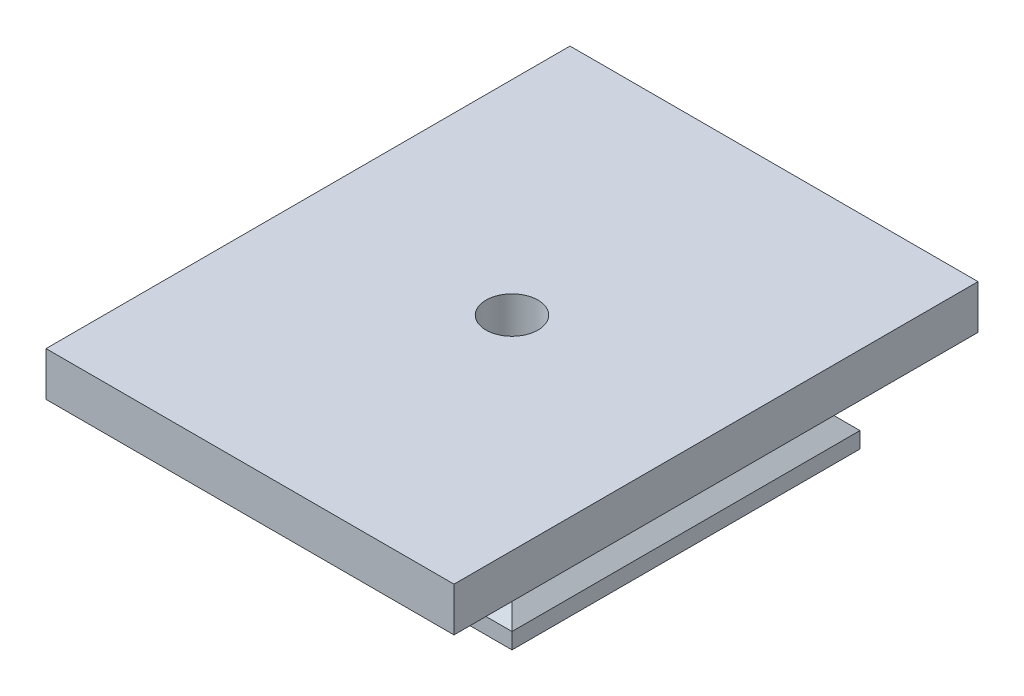
ISO-10303-21;
HEADER;
FILE_DESCRIPTION(('STEP AP214'),'2;1');
FILE_NAME('part.step','',(''),(''),'','','');
FILE_SCHEMA(('AUTOMOTIVE_DESIGN { 1 0 10303 214 1 1 1 1 }'));
ENDSEC;
DATA;
#1=APPLICATION_CONTEXT('core data for automotive mechanical design processes');
#2=APPLICATION_PROTOCOL_DEFINITION('international standard','automotive_design',2000,#1);
#3=PRODUCT_CONTEXT('',#1,'mechanical');
#4=PRODUCT('Part','Part','',(#3));
#5=PRODUCT_RELATED_PRODUCT_CATEGORY('part','',(#4));
#6=PRODUCT_DEFINITION_FORMATION('','',#4);
#7=PRODUCT_DEFINITION_CONTEXT('part definition',#1,'design');
#8=PRODUCT_DEFINITION('design','',#6,#7);
#9=PRODUCT_DEFINITION_SHAPE('','',#8);
#10=(LENGTH_UNIT() NAMED_UNIT(*) SI_UNIT(.MILLI.,.METRE.));
#11=(NAMED_UNIT(*) PLANE_ANGLE_UNIT() SI_UNIT($,.RADIAN.));
#12=(NAMED_UNIT(*) SI_UNIT($,.STERADIAN.) SOLID_ANGLE_UNIT());
#13=UNCERTAINTY_MEASURE_WITH_UNIT(LENGTH_MEASURE(1.E-05),#10,'distance_accuracy_value','');
#14=(GEOMETRIC_REPRESENTATION_CONTEXT(3) GLOBAL_UNCERTAINTY_ASSIGNED_CONTEXT((#13)) GLOBAL_UNIT_ASSIGNED_CONTEXT((#10,
#11,#12)) REPRESENTATION_CONTEXT('',''));
#15=CARTESIAN_POINT('',(0.,0.,0.));
#16=DIRECTION('',(0.,0.,1.));
#17=DIRECTION('',(1.,0.,0.));
#18=AXIS2_PLACEMENT_3D('',#15,#16,#17);
#19=CARTESIAN_POINT('',(-5.95047169811266,14.5,3.38561320754718));
#20=DIRECTION('',(0.,-1.,0.));
#21=DIRECTION('',(0.,0.,-1.));
#22=AXIS2_PLACEMENT_3D('',#19,#20,#21);
#23=CYLINDRICAL_SURFACE('',#22,3.25);
#24=CARTESIAN_POINT('',(-5.95047169811266,14.5,3.38561320754718));
#25=DIRECTION('',(0.,-1.,0.));
#26=DIRECTION('',(0.,0.,-1.));
#27=AXIS2_PLACEMENT_3D('',#24,#25,#26);
#28=CIRCLE('',#27,3.25);
#29=CARTESIAN_POINT('',(-5.95047169811266,14.5,0.135613207547181));
#30=VERTEX_POINT('',#29);
#31=EDGE_CURVE('E190',#30,#30,#28,.T.);
#32=ORIENTED_EDGE('',*,*,#31,.F.);
#33=EDGE_LOOP('',(#32));
#34=FACE_BOUND('',#33,.T.);
#35=CARTESIAN_POINT('',(-5.95047169811266,6.,3.38561320754718));
#36=DIRECTION('',(0.,-1.,0.));
#37=DIRECTION('',(0.,0.,-1.));
#38=AXIS2_PLACEMENT_3D('',#35,#36,#37);
#39=CIRCLE('',#38,3.25);
#40=CARTESIAN_POINT('',(-5.95047169811266,6.,0.135613207547181));
#41=VERTEX_POINT('',#40);
#42=EDGE_CURVE('E179',#41,#41,#39,.F.);
#43=ORIENTED_EDGE('',*,*,#42,.F.);
#44=EDGE_LOOP('',(#43));
#45=FACE_BOUND('',#44,.T.);
#46=ADVANCED_FACE('F45',(#34,#45),#23,.F.);
#47=CARTESIAN_POINT('',(0.,2.,0.));
#48=DIRECTION('',(0.,1.,0.));
#49=DIRECTION('',(0.,0.,1.));
#50=AXIS2_PLACEMENT_3D('',#47,#48,#49);
#51=PLANE('',#50);
#52=DIRECTION('',(-0.866025403784439,0.,-0.5));
#53=VECTOR('',#52,1.);
#54=CARTESIAN_POINT('',(-0.0786314470901516,2.,0.136193661432807));
#55=LINE('',#54,#53);
#56=CARTESIAN_POINT('',(-0.200471698112662,2.,0.0658491597068285));
#57=VERTEX_POINT('',#56);
#58=CARTESIAN_POINT('',(-5.95047169811266,2.,-3.25391488813352));
#59=VERTEX_POINT('',#58);
#60=EDGE_CURVE('E250',#57,#59,#55,.T.);
#61=ORIENTED_EDGE('',*,*,#60,.T.);
#62=DIRECTION('',(-0.866025403784439,0.,0.5));
#63=VECTOR('',#62,1.);
#64=CARTESIAN_POINT('',(-2.89660440196618,2.,-5.01706599363309));
#65=LINE('',#64,#63);
#66=CARTESIAN_POINT('',(-11.7004716981127,2.,0.0658491597068317));
#67=VERTEX_POINT('',#66);
#68=EDGE_CURVE('E12',#59,#67,#65,.T.);
#69=ORIENTED_EDGE('',*,*,#68,.T.);
#70=DIRECTION('',(0.,0.,1.));
#71=VECTOR('',#70,1.);
#72=CARTESIAN_POINT('',(-11.7004716981127,2.,0.));
#73=LINE('',#72,#71);
#74=CARTESIAN_POINT('',(-11.7004716981127,2.,6.70537725538753));
#75=VERTEX_POINT('',#74);
#76=EDGE_CURVE('E53',#67,#75,#73,.T.);
#77=ORIENTED_EDGE('',*,*,#76,.T.);
#78=DIRECTION('',(0.866025403784439,0.,0.5));
#79=VECTOR('',#78,1.);
#80=CARTESIAN_POINT('',(-5.82863144709016,2.,10.0954858049539));
#81=LINE('',#80,#79);
#82=CARTESIAN_POINT('',(-5.95047169811267,2.,10.0251413032279));
#83=VERTEX_POINT('',#82);
#84=EDGE_CURVE('E260',#75,#83,#81,.T.);
#85=ORIENTED_EDGE('',*,*,#84,.T.);
#86=DIRECTION('',(0.866025403784439,0.,-0.5));
#87=VECTOR('',#86,1.);
#88=CARTESIAN_POINT('',(2.85339559803382,2.,4.94222614988796));
#89=LINE('',#88,#87);
#90=CARTESIAN_POINT('',(-0.200471698112664,2.,6.70537725538753));
#91=VERTEX_POINT('',#90);
#92=EDGE_CURVE('E257',#83,#91,#89,.T.);
#93=ORIENTED_EDGE('',*,*,#92,.T.);
#94=DIRECTION('',(0.,0.,-1.));
#95=VECTOR('',#94,1.);
#96=CARTESIAN_POINT('',(-0.200471698112662,2.,0.));
#97=LINE('',#96,#95);
#98=EDGE_CURVE('E254',#91,#57,#97,.T.);
#99=ORIENTED_EDGE('',*,*,#98,.T.);
#100=EDGE_LOOP('',(#61,#69,#77,#85,#93,#99));
#101=FACE_BOUND('',#100,.T.);
#102=DIRECTION('',(0.,0.,1.));
#103=VECTOR('',#102,1.);
#104=CARTESIAN_POINT('',(-27.7004716981132,2.,-18.3643867924528));
#105=LINE('',#104,#103);
#106=CARTESIAN_POINT('',(-27.7004716981132,2.,-18.3643867924528));
#107=VERTEX_POINT('',#106);
#108=CARTESIAN_POINT('',(-27.7004716981132,2.,25.1356132075472));
#109=VERTEX_POINT('',#108);
#110=EDGE_CURVE('E235',#107,#109,#105,.T.);
#111=ORIENTED_EDGE('',*,*,#110,.F.);
#112=DIRECTION('',(-1.,0.,0.));
#113=VECTOR('',#112,1.);
#114=CARTESIAN_POINT('',(-27.7004716981132,2.,-18.3643867924528));
#115=LINE('',#114,#113);
#116=CARTESIAN_POINT('',(15.7995283018868,2.,-18.3643867924528));
#117=VERTEX_POINT('',#116);
#118=EDGE_CURVE('E243',#117,#107,#115,.T.);
#119=ORIENTED_EDGE('',*,*,#118,.F.);
#120=DIRECTION('',(0.,0.,-1.));
#121=VECTOR('',#120,1.);
#122=CARTESIAN_POINT('',(15.7995283018868,2.,-18.3643867924528));
#123=LINE('',#122,#121);
#124=CARTESIAN_POINT('',(15.7995283018868,2.,25.1356132075472));
#125=VERTEX_POINT('',#124);
#126=EDGE_CURVE('E240',#125,#117,#123,.T.);
#127=ORIENTED_EDGE('',*,*,#126,.F.);
#128=DIRECTION('',(1.,0.,0.));
#129=VECTOR('',#128,1.);
#130=CARTESIAN_POINT('',(-27.7004716981132,2.,25.1356132075472));
#131=LINE('',#130,#129);
#132=EDGE_CURVE('E238',#109,#125,#131,.T.);
#133=ORIENTED_EDGE('',*,*,#132,.F.);
#134=EDGE_LOOP('',(#111,#119,#127,#133));
#135=FACE_BOUND('',#134,.T.);
#136=ADVANCED_FACE('F47',(#101,#135),#51,.F.);
#137=CARTESIAN_POINT('',(8.89976415094341,8.89976415094341,-18.3643867924528));
#138=DIRECTION('',(0.707106781186548,0.707106781186547,0.));
#139=DIRECTION('',(-0.707106781186547,0.707106781186548,0.));
#140=AXIS2_PLACEMENT_3D('',#137,#138,#139);
#141=PLANE('',#140);
#142=DIRECTION('',(-0.577350269189626,0.577350269189626,-0.577350269189626));
#143=VECTOR('',#142,1.);
#144=CARTESIAN_POINT('',(-3.30031446540879,21.0998427672956,6.03577044025157));
#145=LINE('',#144,#143);
#146=CARTESIAN_POINT('',(8.79952830188681,9.,18.1356132075472));
#147=VERTEX_POINT('',#146);
#148=EDGE_CURVE('E228',#125,#147,#145,.T.);
#149=ORIENTED_EDGE('',*,*,#148,.F.);
#150=ORIENTED_EDGE('',*,*,#126,.T.);
#151=DIRECTION('',(0.577350269189626,-0.577350269189626,-0.577350269189626));
#152=VECTOR('',#151,1.);
#153=CARTESIAN_POINT('',(11.1996855345912,6.59984276729561,-13.7645440251572));
#154=LINE('',#153,#152);
#155=CARTESIAN_POINT('',(8.79952830188681,9.,-11.3643867924528));
#156=VERTEX_POINT('',#155);
#157=EDGE_CURVE('E225',#156,#117,#154,.T.);
#158=ORIENTED_EDGE('',*,*,#157,.F.);
#159=DIRECTION('',(0.,0.,1.));
#160=VECTOR('',#159,1.);
#161=CARTESIAN_POINT('',(8.79952830188681,9.,-18.3643867924528));
#162=LINE('',#161,#160);
#163=EDGE_CURVE('E233',#156,#147,#162,.T.);
#164=ORIENTED_EDGE('',*,*,#163,.T.);
#165=EDGE_LOOP('',(#149,#150,#158,#164));
#166=FACE_BOUND('',#165,.T.);
#167=ADVANCED_FACE('F289',(#166),#141,.T.);
#168=CARTESIAN_POINT('',(-14.8502358490566,14.8502358490566,-18.3643867924528));
#169=DIRECTION('',(0.707106781186548,-0.707106781186547,0.));
#170=DIRECTION('',(0.707106781186547,0.707106781186548,0.));
#171=AXIS2_PLACEMENT_3D('',#168,#169,#170);
#172=PLANE('',#171);
#173=ORIENTED_EDGE('',*,*,#110,.T.);
#174=DIRECTION('',(0.577350269189626,0.577350269189626,-0.577350269189626));
#175=VECTOR('',#174,1.);
#176=CARTESIAN_POINT('',(-4.63364779874212,25.0668238993711,2.06878930817611));
#177=LINE('',#176,#175);
#178=CARTESIAN_POINT('',(-20.7004716981132,9.,18.1356132075472));
#179=VERTEX_POINT('',#178);
#180=EDGE_CURVE('E248',#109,#179,#177,.T.);
#181=ORIENTED_EDGE('',*,*,#180,.T.);
#182=DIRECTION('',(0.,0.,1.));
#183=VECTOR('',#182,1.);
#184=CARTESIAN_POINT('',(-20.7004716981132,9.,-18.3643867924528));
#185=LINE('',#184,#183);
#186=CARTESIAN_POINT('',(-20.7004716981132,9.,-11.3643867924528));
#187=VERTEX_POINT('',#186);
#188=EDGE_CURVE('E230',#187,#179,#185,.T.);
#189=ORIENTED_EDGE('',*,*,#188,.F.);
#190=DIRECTION('',(-0.577350269189626,-0.577350269189626,-0.577350269189626));
#191=VECTOR('',#190,1.);
#192=CARTESIAN_POINT('',(-19.1336477987421,10.5668238993711,-9.79756289308177));
#193=LINE('',#192,#191);
#194=EDGE_CURVE('E245',#187,#107,#193,.T.);
#195=ORIENTED_EDGE('',*,*,#194,.T.);
#196=EDGE_LOOP('',(#173,#181,#189,#195));
#197=FACE_BOUND('',#196,.T.);
#198=ADVANCED_FACE('F324',(#197),#172,.F.);
#199=CARTESIAN_POINT('',(-27.7004716981132,9.,-11.3643867924528));
#200=DIRECTION('',(0.,-0.707106781186547,0.707106781186548));
#201=DIRECTION('',(0.,-0.707106781186548,-0.707106781186547));
#202=AXIS2_PLACEMENT_3D('',#199,#200,#201);
#203=PLANE('',#202);
#204=ORIENTED_EDGE('',*,*,#157,.T.);
#205=ORIENTED_EDGE('',*,*,#118,.T.);
#206=ORIENTED_EDGE('',*,*,#194,.F.);
#207=DIRECTION('',(1.,0.,0.));
#208=VECTOR('',#207,1.);
#209=CARTESIAN_POINT('',(-27.7004716981132,9.,-11.3643867924528));
#210=LINE('',#209,#208);
#211=EDGE_CURVE('E223',#187,#156,#210,.T.);
#212=ORIENTED_EDGE('',*,*,#211,.T.);
#213=EDGE_LOOP('',(#204,#205,#206,#212));
#214=FACE_BOUND('',#213,.T.);
#215=ADVANCED_FACE('F321',(#214),#203,.F.);
#216=CARTESIAN_POINT('',(-27.7004716981132,9.,18.1356132075472));
#217=DIRECTION('',(0.,-0.707106781186547,-0.707106781186547));
#218=DIRECTION('',(0.,0.707106781186548,-0.707106781186548));
#219=AXIS2_PLACEMENT_3D('',#216,#217,#218);
#220=PLANE('',#219);
#221=ORIENTED_EDGE('',*,*,#148,.T.);
#222=DIRECTION('',(1.,0.,0.));
#223=VECTOR('',#222,1.);
#224=CARTESIAN_POINT('',(-27.7004716981132,9.,18.1356132075472));
#225=LINE('',#224,#223);
#226=EDGE_CURVE('E68',#179,#147,#225,.T.);
#227=ORIENTED_EDGE('',*,*,#226,.F.);
#228=ORIENTED_EDGE('',*,*,#180,.F.);
#229=ORIENTED_EDGE('',*,*,#132,.T.);
#230=EDGE_LOOP('',(#221,#227,#228,#229));
#231=FACE_BOUND('',#230,.T.);
#232=ADVANCED_FACE('F303',(#231),#220,.F.);
#233=CARTESIAN_POINT('',(0.,9.,0.));
#234=DIRECTION('',(0.,1.,0.));
#235=DIRECTION('',(0.,0.,1.));
#236=AXIS2_PLACEMENT_3D('',#233,#234,#235);
#237=PLANE('',#236);
#238=DIRECTION('',(0.,0.,1.));
#239=VECTOR('',#238,1.);
#240=CARTESIAN_POINT('',(-31.4504716981132,9.,36.1356132075472));
#241=LINE('',#240,#239);
#242=CARTESIAN_POINT('',(-31.4504716981132,9.,-29.3643867924528));
#243=VERTEX_POINT('',#242);
#244=CARTESIAN_POINT('',(-31.4504716981132,9.,36.1356132075472));
#245=VERTEX_POINT('',#244);
#246=EDGE_CURVE('E193',#243,#245,#241,.T.);
#247=ORIENTED_EDGE('',*,*,#246,.F.);
#248=DIRECTION('',(-1.,0.,0.));
#249=VECTOR('',#248,1.);
#250=CARTESIAN_POINT('',(19.5495283018868,9.,-29.3643867924528));
#251=LINE('',#250,#249);
#252=CARTESIAN_POINT('',(19.5495283018868,9.,-29.3643867924528));
#253=VERTEX_POINT('',#252);
#254=EDGE_CURVE('E198',#253,#243,#251,.T.);
#255=ORIENTED_EDGE('',*,*,#254,.F.);
#256=DIRECTION('',(0.,0.,-1.));
#257=VECTOR('',#256,1.);
#258=CARTESIAN_POINT('',(19.5495283018868,9.,36.1356132075472));
#259=LINE('',#258,#257);
#260=CARTESIAN_POINT('',(19.5495283018868,9.,36.1356132075472));
#261=VERTEX_POINT('',#260);
#262=EDGE_CURVE('E209',#261,#253,#259,.T.);
#263=ORIENTED_EDGE('',*,*,#262,.F.);
#264=DIRECTION('',(1.,0.,0.));
#265=VECTOR('',#264,1.);
#266=CARTESIAN_POINT('',(19.5495283018868,9.,36.1356132075472));
#267=LINE('',#266,#265);
#268=EDGE_CURVE('E207',#245,#261,#267,.T.);
#269=ORIENTED_EDGE('',*,*,#268,.F.);
#270=EDGE_LOOP('',(#247,#255,#263,#269));
#271=FACE_BOUND('',#270,.T.);
#272=ORIENTED_EDGE('',*,*,#163,.F.);
#273=ORIENTED_EDGE('',*,*,#211,.F.);
#274=ORIENTED_EDGE('',*,*,#188,.T.);
#275=ORIENTED_EDGE('',*,*,#226,.T.);
#276=EDGE_LOOP('',(#272,#273,#274,#275));
#277=FACE_BOUND('',#276,.T.);
#278=ADVANCED_FACE('F299',(#271,#277),#237,.F.);
#279=CARTESIAN_POINT('',(-31.4504716981132,14.5,36.1356132075472));
#280=DIRECTION('',(1.,0.,0.));
#281=DIRECTION('',(0.,0.,-1.));
#282=AXIS2_PLACEMENT_3D('',#279,#280,#281);
#283=PLANE('',#282);
#284=ORIENTED_EDGE('',*,*,#246,.T.);
#285=DIRECTION('',(0.,-1.,0.));
#286=VECTOR('',#285,1.);
#287=CARTESIAN_POINT('',(-31.4504716981132,14.5,36.1356132075472));
#288=LINE('',#287,#286);
#289=CARTESIAN_POINT('',(-31.4504716981132,14.5,36.1356132075472));
#290=VERTEX_POINT('',#289);
#291=EDGE_CURVE('E220',#290,#245,#288,.T.);
#292=ORIENTED_EDGE('',*,*,#291,.F.);
#293=DIRECTION('',(0.,0.,1.));
#294=VECTOR('',#293,1.);
#295=CARTESIAN_POINT('',(-31.4504716981132,14.5,36.1356132075472));
#296=LINE('',#295,#294);
#297=CARTESIAN_POINT('',(-31.4504716981132,14.5,-29.3643867924528));
#298=VERTEX_POINT('',#297);
#299=EDGE_CURVE('E194',#298,#290,#296,.T.);
#300=ORIENTED_EDGE('',*,*,#299,.F.);
#301=DIRECTION('',(0.,-1.,0.));
#302=VECTOR('',#301,1.);
#303=CARTESIAN_POINT('',(-31.4504716981132,14.5,-29.3643867924528));
#304=LINE('',#303,#302);
#305=EDGE_CURVE('E204',#298,#243,#304,.T.);
#306=ORIENTED_EDGE('',*,*,#305,.T.);
#307=EDGE_LOOP('',(#284,#292,#300,#306));
#308=FACE_BOUND('',#307,.T.);
#309=ADVANCED_FACE('F302',(#308),#283,.F.);
#310=CARTESIAN_POINT('',(19.5495283018868,14.5,36.1356132075472));
#311=DIRECTION('',(0.,0.,-1.));
#312=DIRECTION('',(-1.,0.,0.));
#313=AXIS2_PLACEMENT_3D('',#310,#311,#312);
#314=PLANE('',#313);
#315=ORIENTED_EDGE('',*,*,#268,.T.);
#316=DIRECTION('',(0.,-1.,0.));
#317=VECTOR('',#316,1.);
#318=CARTESIAN_POINT('',(19.5495283018868,14.5,36.1356132075472));
#319=LINE('',#318,#317);
#320=CARTESIAN_POINT('',(19.5495283018868,14.5,36.1356132075472));
#321=VERTEX_POINT('',#320);
#322=EDGE_CURVE('E217',#321,#261,#319,.T.);
#323=ORIENTED_EDGE('',*,*,#322,.F.);
#324=DIRECTION('',(1.,0.,0.));
#325=VECTOR('',#324,1.);
#326=CARTESIAN_POINT('',(19.5495283018868,14.5,36.1356132075472));
#327=LINE('',#326,#325);
#328=EDGE_CURVE('E197',#290,#321,#327,.T.);
#329=ORIENTED_EDGE('',*,*,#328,.F.);
#330=ORIENTED_EDGE('',*,*,#291,.T.);
#331=EDGE_LOOP('',(#315,#323,#329,#330));
#332=FACE_BOUND('',#331,.T.);
#333=ADVANCED_FACE('F311',(#332),#314,.F.);
#334=CARTESIAN_POINT('',(19.5495283018868,14.5,36.1356132075472));
#335=DIRECTION('',(-1.,0.,0.));
#336=DIRECTION('',(0.,0.,1.));
#337=AXIS2_PLACEMENT_3D('',#334,#335,#336);
#338=PLANE('',#337);
#339=ORIENTED_EDGE('',*,*,#262,.T.);
#340=DIRECTION('',(0.,-1.,0.));
#341=VECTOR('',#340,1.);
#342=CARTESIAN_POINT('',(19.5495283018868,14.5,-29.3643867924528));
#343=LINE('',#342,#341);
#344=CARTESIAN_POINT('',(19.5495283018868,14.5,-29.3643867924528));
#345=VERTEX_POINT('',#344);
#346=EDGE_CURVE('E214',#345,#253,#343,.T.);
#347=ORIENTED_EDGE('',*,*,#346,.F.);
#348=DIRECTION('',(0.,0.,-1.));
#349=VECTOR('',#348,1.);
#350=CARTESIAN_POINT('',(19.5495283018868,14.5,36.1356132075472));
#351=LINE('',#350,#349);
#352=EDGE_CURVE('E200',#321,#345,#351,.T.);
#353=ORIENTED_EDGE('',*,*,#352,.F.);
#354=ORIENTED_EDGE('',*,*,#322,.T.);
#355=EDGE_LOOP('',(#339,#347,#353,#354));
#356=FACE_BOUND('',#355,.T.);
#357=ADVANCED_FACE('F307',(#356),#338,.F.);
#358=CARTESIAN_POINT('',(19.5495283018868,14.5,-29.3643867924528));
#359=DIRECTION('',(0.,0.,1.));
#360=DIRECTION('',(1.,0.,0.));
#361=AXIS2_PLACEMENT_3D('',#358,#359,#360);
#362=PLANE('',#361);
#363=ORIENTED_EDGE('',*,*,#254,.T.);
#364=ORIENTED_EDGE('',*,*,#305,.F.);
#365=DIRECTION('',(-1.,0.,0.));
#366=VECTOR('',#365,1.);
#367=CARTESIAN_POINT('',(19.5495283018868,14.5,-29.3643867924528));
#368=LINE('',#367,#366);
#369=EDGE_CURVE('E202',#345,#298,#368,.T.);
#370=ORIENTED_EDGE('',*,*,#369,.F.);
#371=ORIENTED_EDGE('',*,*,#346,.T.);
#372=EDGE_LOOP('',(#363,#364,#370,#371));
#373=FACE_BOUND('',#372,.T.);
#374=ADVANCED_FACE('F297',(#373),#362,.F.);
#375=CARTESIAN_POINT('',(0.,14.5,0.));
#376=DIRECTION('',(0.,1.,0.));
#377=DIRECTION('',(0.,0.,1.));
#378=AXIS2_PLACEMENT_3D('',#375,#376,#377);
#379=PLANE('',#378);
#380=ORIENTED_EDGE('',*,*,#31,.T.);
#381=EDGE_LOOP('',(#380));
#382=FACE_BOUND('',#381,.T.);
#383=ORIENTED_EDGE('',*,*,#299,.T.);
#384=ORIENTED_EDGE('',*,*,#328,.T.);
#385=ORIENTED_EDGE('',*,*,#352,.T.);
#386=ORIENTED_EDGE('',*,*,#369,.T.);
#387=EDGE_LOOP('',(#383,#384,#385,#386));
#388=FACE_BOUND('',#387,.T.);
#389=ADVANCED_FACE('F294',(#382,#388),#379,.T.);
#390=CARTESIAN_POINT('',(-11.7004716981127,6.,0.0658491597068317));
#391=DIRECTION('',(-0.5,0.,-0.866025403784438));
#392=DIRECTION('',(-0.866025403784439,0.,0.5));
#393=AXIS2_PLACEMENT_3D('',#390,#391,#392);
#394=PLANE('',#393);
#395=DIRECTION('',(0.,-1.,0.));
#396=VECTOR('',#395,1.);
#397=CARTESIAN_POINT('',(-5.95047169811266,6.,-3.25391488813352));
#398=LINE('',#397,#396);
#399=CARTESIAN_POINT('',(-5.95047169811266,6.,-3.25391488813352));
#400=VERTEX_POINT('',#399);
#401=EDGE_CURVE('E60',#400,#59,#398,.T.);
#402=ORIENTED_EDGE('',*,*,#401,.F.);
#403=DIRECTION('',(0.866025403784439,0.,-0.5));
#404=VECTOR('',#403,1.);
#405=CARTESIAN_POINT('',(-11.7004716981127,6.,0.0658491597068317));
#406=LINE('',#405,#404);
#407=CARTESIAN_POINT('',(-11.7004716981127,6.,0.0658491597068317));
#408=VERTEX_POINT('',#407);
#409=EDGE_CURVE('E149',#408,#400,#406,.T.);
#410=ORIENTED_EDGE('',*,*,#409,.F.);
#411=DIRECTION('',(0.,-1.,0.));
#412=VECTOR('',#411,1.);
#413=CARTESIAN_POINT('',(-11.7004716981127,6.,0.0658491597068317));
#414=LINE('',#413,#412);
#415=EDGE_CURVE('E177',#408,#67,#414,.T.);
#416=ORIENTED_EDGE('',*,*,#415,.T.);
#417=ORIENTED_EDGE('',*,*,#68,.F.);
#418=EDGE_LOOP('',(#402,#410,#416,#417));
#419=FACE_BOUND('',#418,.T.);
#420=ADVANCED_FACE('F146',(#419),#394,.F.);
#421=CARTESIAN_POINT('',(-11.7004716981127,6.,6.70537725538753));
#422=DIRECTION('',(-1.,0.,0.));
#423=DIRECTION('',(0.,0.,1.));
#424=AXIS2_PLACEMENT_3D('',#421,#422,#423);
#425=PLANE('',#424);
#426=ORIENTED_EDGE('',*,*,#415,.F.);
#427=DIRECTION('',(0.,0.,-1.));
#428=VECTOR('',#427,1.);
#429=CARTESIAN_POINT('',(-11.7004716981127,6.,6.70537725538753));
#430=LINE('',#429,#428);
#431=CARTESIAN_POINT('',(-11.7004716981127,6.,6.70537725538753));
#432=VERTEX_POINT('',#431);
#433=EDGE_CURVE('E153',#432,#408,#430,.T.);
#434=ORIENTED_EDGE('',*,*,#433,.F.);
#435=DIRECTION('',(0.,-1.,0.));
#436=VECTOR('',#435,1.);
#437=CARTESIAN_POINT('',(-11.7004716981127,6.,6.70537725538753));
#438=LINE('',#437,#436);
#439=EDGE_CURVE('E180',#432,#75,#438,.T.);
#440=ORIENTED_EDGE('',*,*,#439,.T.);
#441=ORIENTED_EDGE('',*,*,#76,.F.);
#442=EDGE_LOOP('',(#426,#434,#440,#441));
#443=FACE_BOUND('',#442,.T.);
#444=ADVANCED_FACE('F266',(#443),#425,.F.);
#445=CARTESIAN_POINT('',(-5.95047169811267,6.,10.0251413032279));
#446=DIRECTION('',(-0.5,0.,0.866025403784439));
#447=DIRECTION('',(0.866025403784439,0.,0.5));
#448=AXIS2_PLACEMENT_3D('',#445,#446,#447);
#449=PLANE('',#448);
#450=ORIENTED_EDGE('',*,*,#439,.F.);
#451=DIRECTION('',(-0.866025403784439,0.,-0.5));
#452=VECTOR('',#451,1.);
#453=CARTESIAN_POINT('',(-5.95047169811267,6.,10.0251413032279));
#454=LINE('',#453,#452);
#455=CARTESIAN_POINT('',(-5.95047169811267,6.,10.0251413032279));
#456=VERTEX_POINT('',#455);
#457=EDGE_CURVE('E174',#456,#432,#454,.T.);
#458=ORIENTED_EDGE('',*,*,#457,.F.);
#459=DIRECTION('',(0.,-1.,0.));
#460=VECTOR('',#459,1.);
#461=CARTESIAN_POINT('',(-5.95047169811267,6.,10.0251413032279));
#462=LINE('',#461,#460);
#463=EDGE_CURVE('E183',#456,#83,#462,.T.);
#464=ORIENTED_EDGE('',*,*,#463,.T.);
#465=ORIENTED_EDGE('',*,*,#84,.F.);
#466=EDGE_LOOP('',(#450,#458,#464,#465));
#467=FACE_BOUND('',#466,.T.);
#468=ADVANCED_FACE('F269',(#467),#449,.F.);
#469=CARTESIAN_POINT('',(-0.200471698112664,6.,6.70537725538753));
#470=DIRECTION('',(0.5,0.,0.866025403784439));
#471=DIRECTION('',(0.866025403784439,0.,-0.5));
#472=AXIS2_PLACEMENT_3D('',#469,#470,#471);
#473=PLANE('',#472);
#474=ORIENTED_EDGE('',*,*,#463,.F.);
#475=DIRECTION('',(-0.866025403784439,0.,0.5));
#476=VECTOR('',#475,1.);
#477=CARTESIAN_POINT('',(-0.200471698112664,6.,6.70537725538753));
#478=LINE('',#477,#476);
#479=CARTESIAN_POINT('',(-0.200471698112664,6.,6.70537725538753));
#480=VERTEX_POINT('',#479);
#481=EDGE_CURVE('E171',#480,#456,#478,.T.);
#482=ORIENTED_EDGE('',*,*,#481,.F.);
#483=DIRECTION('',(0.,-1.,0.));
#484=VECTOR('',#483,1.);
#485=CARTESIAN_POINT('',(-0.200471698112664,6.,6.70537725538753));
#486=LINE('',#485,#484);
#487=EDGE_CURVE('E186',#480,#91,#486,.T.);
#488=ORIENTED_EDGE('',*,*,#487,.T.);
#489=ORIENTED_EDGE('',*,*,#92,.F.);
#490=EDGE_LOOP('',(#474,#482,#488,#489));
#491=FACE_BOUND('',#490,.T.);
#492=ADVANCED_FACE('F272',(#491),#473,.F.);
#493=CARTESIAN_POINT('',(-0.200471698112662,6.,0.0658491597068285));
#494=DIRECTION('',(1.,0.,0.));
#495=DIRECTION('',(0.,0.,-1.));
#496=AXIS2_PLACEMENT_3D('',#493,#494,#495);
#497=PLANE('',#496);
#498=ORIENTED_EDGE('',*,*,#487,.F.);
#499=DIRECTION('',(0.,0.,1.));
#500=VECTOR('',#499,1.);
#501=CARTESIAN_POINT('',(-0.200471698112662,6.,0.0658491597068285));
#502=LINE('',#501,#500);
#503=CARTESIAN_POINT('',(-0.200471698112662,6.,0.0658491597068285));
#504=VERTEX_POINT('',#503);
#505=EDGE_CURVE('E162',#504,#480,#502,.T.);
#506=ORIENTED_EDGE('',*,*,#505,.F.);
#507=DIRECTION('',(0.,-1.,0.));
#508=VECTOR('',#507,1.);
#509=CARTESIAN_POINT('',(-0.200471698112662,6.,0.0658491597068285));
#510=LINE('',#509,#508);
#511=EDGE_CURVE('E152',#504,#57,#510,.T.);
#512=ORIENTED_EDGE('',*,*,#511,.T.);
#513=ORIENTED_EDGE('',*,*,#98,.F.);
#514=EDGE_LOOP('',(#498,#506,#512,#513));
#515=FACE_BOUND('',#514,.T.);
#516=ADVANCED_FACE('F274',(#515),#497,.F.);
#517=CARTESIAN_POINT('',(-5.95047169811266,6.,-3.25391488813352));
#518=DIRECTION('',(0.5,0.,-0.866025403784439));
#519=DIRECTION('',(-0.866025403784439,0.,-0.5));
#520=AXIS2_PLACEMENT_3D('',#517,#518,#519);
#521=PLANE('',#520);
#522=ORIENTED_EDGE('',*,*,#511,.F.);
#523=DIRECTION('',(0.866025403784439,0.,0.5));
#524=VECTOR('',#523,1.);
#525=CARTESIAN_POINT('',(-5.95047169811266,6.,-3.25391488813352));
#526=LINE('',#525,#524);
#527=EDGE_CURVE('E156',#400,#504,#526,.T.);
#528=ORIENTED_EDGE('',*,*,#527,.F.);
#529=ORIENTED_EDGE('',*,*,#401,.T.);
#530=ORIENTED_EDGE('',*,*,#60,.F.);
#531=EDGE_LOOP('',(#522,#528,#529,#530));
#532=FACE_BOUND('',#531,.T.);
#533=ADVANCED_FACE('F157',(#532),#521,.F.);
#534=CARTESIAN_POINT('',(0.,6.,0.));
#535=DIRECTION('',(0.,-1.,0.));
#536=DIRECTION('',(0.,0.,-1.));
#537=AXIS2_PLACEMENT_3D('',#534,#535,#536);
#538=PLANE('',#537);
#539=ORIENTED_EDGE('',*,*,#409,.T.);
#540=ORIENTED_EDGE('',*,*,#527,.T.);
#541=ORIENTED_EDGE('',*,*,#505,.T.);
#542=ORIENTED_EDGE('',*,*,#481,.T.);
#543=ORIENTED_EDGE('',*,*,#457,.T.);
#544=ORIENTED_EDGE('',*,*,#433,.T.);
#545=EDGE_LOOP('',(#539,#540,#541,#542,#543,#544));
#546=FACE_BOUND('',#545,.T.);
#547=ORIENTED_EDGE('',*,*,#42,.T.);
#548=EDGE_LOOP('',(#547));
#549=FACE_BOUND('',#548,.T.);
#550=ADVANCED_FACE('F164',(#546,#549),#538,.T.);
#551=CLOSED_SHELL('',(#46,#136,#167,#198,#215,#232,#278,#309,#333,#357,#374,#389,#420,#444,#468,
#492,#516,#533,#550));
#552=MANIFOLD_SOLID_BREP('B2',#551);
#553=CARTESIAN_POINT('',(-27.7004716981132,2.,-18.3643867924528));
#554=DIRECTION('',(1.,0.,0.));
#555=DIRECTION('',(0.,0.,-1.));
#556=AXIS2_PLACEMENT_3D('',#553,#554,#555);
#557=PLANE('',#556);
#558=DIRECTION('',(0.,0.,1.));
#559=VECTOR('',#558,1.);
#560=CARTESIAN_POINT('',(-27.7004716981132,0.,-18.3643867924528));
#561=LINE('',#560,#559);
#562=CARTESIAN_POINT('',(-27.7004716981132,0.,-18.3643867924528));
#563=VERTEX_POINT('',#562);
#564=CARTESIAN_POINT('',(-27.7004716981132,0.,25.1356132075472));
#565=VERTEX_POINT('',#564);
#566=EDGE_CURVE('E598',#563,#565,#561,.T.);
#567=ORIENTED_EDGE('',*,*,#566,.T.);
#568=DIRECTION('',(0.,-1.,0.));
#569=VECTOR('',#568,1.);
#570=CARTESIAN_POINT('',(-27.7004716981132,2.,25.1356132075472));
#571=LINE('',#570,#569);
#572=CARTESIAN_POINT('',(-27.7004716981132,2.,25.1356132075472));
#573=VERTEX_POINT('',#572);
#574=EDGE_CURVE('E43',#573,#565,#571,.T.);
#575=ORIENTED_EDGE('',*,*,#574,.F.);
#576=DIRECTION('',(0.,0.,1.));
#577=VECTOR('',#576,1.);
#578=CARTESIAN_POINT('',(-27.7004716981132,2.,-18.3643867924528));
#579=LINE('',#578,#577);
#580=CARTESIAN_POINT('',(-27.7004716981132,2.,-18.3643867924528));
#581=VERTEX_POINT('',#580);
#582=EDGE_CURVE('E599',#581,#573,#579,.T.);
#583=ORIENTED_EDGE('',*,*,#582,.F.);
#584=DIRECTION('',(0.,-1.,0.));
#585=VECTOR('',#584,1.);
#586=CARTESIAN_POINT('',(-27.7004716981132,2.,-18.3643867924528));
#587=LINE('',#586,#585);
#588=EDGE_CURVE('E609',#581,#563,#587,.T.);
#589=ORIENTED_EDGE('',*,*,#588,.T.);
#590=EDGE_LOOP('',(#567,#575,#583,#589));
#591=FACE_BOUND('',#590,.T.);
#592=ADVANCED_FACE('F472',(#591),#557,.F.);
#593=CARTESIAN_POINT('',(-27.7004716981132,2.,25.1356132075472));
#594=DIRECTION('',(0.,0.,-1.));
#595=DIRECTION('',(-1.,0.,0.));
#596=AXIS2_PLACEMENT_3D('',#593,#594,#595);
#597=PLANE('',#596);
#598=DIRECTION('',(1.,0.,0.));
#599=VECTOR('',#598,1.);
#600=CARTESIAN_POINT('',(-27.7004716981132,0.,25.1356132075472));
#601=LINE('',#600,#599);
#602=CARTESIAN_POINT('',(15.7995283018868,0.,25.1356132075472));
#603=VERTEX_POINT('',#602);
#604=EDGE_CURVE('E612',#565,#603,#601,.T.);
#605=ORIENTED_EDGE('',*,*,#604,.T.);
#606=DIRECTION('',(0.,-1.,0.));
#607=VECTOR('',#606,1.);
#608=CARTESIAN_POINT('',(15.7995283018868,2.,25.1356132075472));
#609=LINE('',#608,#607);
#610=CARTESIAN_POINT('',(15.7995283018868,2.,25.1356132075472));
#611=VERTEX_POINT('',#610);
#612=EDGE_CURVE('E479',#611,#603,#609,.T.);
#613=ORIENTED_EDGE('',*,*,#612,.F.);
#614=DIRECTION('',(1.,0.,0.));
#615=VECTOR('',#614,1.);
#616=CARTESIAN_POINT('',(-27.7004716981132,2.,25.1356132075472));
#617=LINE('',#616,#615);
#618=EDGE_CURVE('E602',#573,#611,#617,.T.);
#619=ORIENTED_EDGE('',*,*,#618,.F.);
#620=ORIENTED_EDGE('',*,*,#574,.T.);
#621=EDGE_LOOP('',(#605,#613,#619,#620));
#622=FACE_BOUND('',#621,.T.);
#623=ADVANCED_FACE('F640',(#622),#597,.F.);
#624=CARTESIAN_POINT('',(15.7995283018868,2.,-18.3643867924528));
#625=DIRECTION('',(-1.,0.,0.));
#626=DIRECTION('',(0.,0.,1.));
#627=AXIS2_PLACEMENT_3D('',#624,#625,#626);
#628=PLANE('',#627);
#629=DIRECTION('',(0.,0.,-1.));
#630=VECTOR('',#629,1.);
#631=CARTESIAN_POINT('',(15.7995283018868,0.,-18.3643867924528));
#632=LINE('',#631,#630);
#633=CARTESIAN_POINT('',(15.7995283018868,0.,-18.3643867924528));
#634=VERTEX_POINT('',#633);
#635=EDGE_CURVE('E614',#603,#634,#632,.T.);
#636=ORIENTED_EDGE('',*,*,#635,.T.);
#637=DIRECTION('',(0.,-1.,0.));
#638=VECTOR('',#637,1.);
#639=CARTESIAN_POINT('',(15.7995283018868,2.,-18.3643867924528));
#640=LINE('',#639,#638);
#641=CARTESIAN_POINT('',(15.7995283018868,2.,-18.3643867924528));
#642=VERTEX_POINT('',#641);
#643=EDGE_CURVE('E619',#642,#634,#640,.T.);
#644=ORIENTED_EDGE('',*,*,#643,.F.);
#645=DIRECTION('',(0.,0.,-1.));
#646=VECTOR('',#645,1.);
#647=CARTESIAN_POINT('',(15.7995283018868,2.,-18.3643867924528));
#648=LINE('',#647,#646);
#649=EDGE_CURVE('E605',#611,#642,#648,.T.);
#650=ORIENTED_EDGE('',*,*,#649,.F.);
#651=ORIENTED_EDGE('',*,*,#612,.T.);
#652=EDGE_LOOP('',(#636,#644,#650,#651));
#653=FACE_BOUND('',#652,.T.);
#654=ADVANCED_FACE('F626',(#653),#628,.F.);
#655=CARTESIAN_POINT('',(-27.7004716981132,2.,-18.3643867924528));
#656=DIRECTION('',(0.,0.,1.));
#657=DIRECTION('',(1.,0.,0.));
#658=AXIS2_PLACEMENT_3D('',#655,#656,#657);
#659=PLANE('',#658);
#660=DIRECTION('',(-1.,0.,0.));
#661=VECTOR('',#660,1.);
#662=CARTESIAN_POINT('',(-27.7004716981132,0.,-18.3643867924528));
#663=LINE('',#662,#661);
#664=EDGE_CURVE('E603',#634,#563,#663,.T.);
#665=ORIENTED_EDGE('',*,*,#664,.T.);
#666=ORIENTED_EDGE('',*,*,#588,.F.);
#667=DIRECTION('',(-1.,0.,0.));
#668=VECTOR('',#667,1.);
#669=CARTESIAN_POINT('',(-27.7004716981132,2.,-18.3643867924528));
#670=LINE('',#669,#668);
#671=EDGE_CURVE('E607',#642,#581,#670,.T.);
#672=ORIENTED_EDGE('',*,*,#671,.F.);
#673=ORIENTED_EDGE('',*,*,#643,.T.);
#674=EDGE_LOOP('',(#665,#666,#672,#673));
#675=FACE_BOUND('',#674,.T.);
#676=ADVANCED_FACE('F633',(#675),#659,.F.);
#677=CARTESIAN_POINT('',(0.,2.,0.));
#678=DIRECTION('',(0.,1.,0.));
#679=DIRECTION('',(0.,0.,1.));
#680=AXIS2_PLACEMENT_3D('',#677,#678,#679);
#681=PLANE('',#680);
#682=DIRECTION('',(-0.866025403784439,0.,0.5));
#683=VECTOR('',#682,1.);
#684=CARTESIAN_POINT('',(-2.89660440196618,2.,-5.01706599363309));
#685=LINE('',#684,#683);
#686=CARTESIAN_POINT('',(-5.95047169811266,2.,-3.25391488813352));
#687=VERTEX_POINT('',#686);
#688=CARTESIAN_POINT('',(-11.7004716981127,2.,0.0658491597068317));
#689=VERTEX_POINT('',#688);
#690=EDGE_CURVE('E596',#687,#689,#685,.T.);
#691=ORIENTED_EDGE('',*,*,#690,.F.);
#692=DIRECTION('',(-0.866025403784439,0.,-0.5));
#693=VECTOR('',#692,1.);
#694=CARTESIAN_POINT('',(-0.0786314470901516,2.,0.136193661432807));
#695=LINE('',#694,#693);
#696=CARTESIAN_POINT('',(-0.200471698112662,2.,0.0658491597068285));
#697=VERTEX_POINT('',#696);
#698=EDGE_CURVE('E581',#697,#687,#695,.T.);
#699=ORIENTED_EDGE('',*,*,#698,.F.);
#700=DIRECTION('',(0.,0.,-1.));
#701=VECTOR('',#700,1.);
#702=CARTESIAN_POINT('',(-0.200471698112662,2.,0.));
#703=LINE('',#702,#701);
#704=CARTESIAN_POINT('',(-0.200471698112664,2.,6.70537725538753));
#705=VERTEX_POINT('',#704);
#706=EDGE_CURVE('E554',#705,#697,#703,.T.);
#707=ORIENTED_EDGE('',*,*,#706,.F.);
#708=DIRECTION('',(0.866025403784439,0.,-0.5));
#709=VECTOR('',#708,1.);
#710=CARTESIAN_POINT('',(2.85339559803382,2.,4.94222614988796));
#711=LINE('',#710,#709);
#712=CARTESIAN_POINT('',(-5.95047169811267,2.,10.0251413032279));
#713=VERTEX_POINT('',#712);
#714=EDGE_CURVE('E590',#713,#705,#711,.T.);
#715=ORIENTED_EDGE('',*,*,#714,.F.);
#716=DIRECTION('',(0.866025403784439,0.,0.5));
#717=VECTOR('',#716,1.);
#718=CARTESIAN_POINT('',(-5.82863144709016,2.,10.0954858049539));
#719=LINE('',#718,#717);
#720=CARTESIAN_POINT('',(-11.7004716981127,2.,6.70537725538753));
#721=VERTEX_POINT('',#720);
#722=EDGE_CURVE('E592',#721,#713,#719,.T.);
#723=ORIENTED_EDGE('',*,*,#722,.F.);
#724=DIRECTION('',(0.,0.,1.));
#725=VECTOR('',#724,1.);
#726=CARTESIAN_POINT('',(-11.7004716981127,2.,0.));
#727=LINE('',#726,#725);
#728=EDGE_CURVE('E594',#689,#721,#727,.T.);
#729=ORIENTED_EDGE('',*,*,#728,.F.);
#730=EDGE_LOOP('',(#691,#699,#707,#715,#723,#729));
#731=FACE_BOUND('',#730,.T.);
#732=ORIENTED_EDGE('',*,*,#582,.T.);
#733=ORIENTED_EDGE('',*,*,#618,.T.);
#734=ORIENTED_EDGE('',*,*,#649,.T.);
#735=ORIENTED_EDGE('',*,*,#671,.T.);
#736=EDGE_LOOP('',(#732,#733,#734,#735));
#737=FACE_BOUND('',#736,.T.);
#738=ADVANCED_FACE('F639',(#731,#737),#681,.T.);
#739=CARTESIAN_POINT('',(0.,0.,0.));
#740=DIRECTION('',(0.,1.,0.));
#741=DIRECTION('',(0.,0.,1.));
#742=AXIS2_PLACEMENT_3D('',#739,#740,#741);
#743=PLANE('',#742);
#744=DIRECTION('',(0.866025403784439,0.,0.5));
#745=VECTOR('',#744,1.);
#746=CARTESIAN_POINT('',(-5.95047169811266,0.,-3.25391488813352));
#747=LINE('',#746,#745);
#748=CARTESIAN_POINT('',(-5.95047169811266,0.,-3.25391488813352));
#749=VERTEX_POINT('',#748);
#750=CARTESIAN_POINT('',(-0.200471698112662,0.,0.0658491597068285));
#751=VERTEX_POINT('',#750);
#752=EDGE_CURVE('E560',#749,#751,#747,.T.);
#753=ORIENTED_EDGE('',*,*,#752,.F.);
#754=DIRECTION('',(0.866025403784439,0.,-0.5));
#755=VECTOR('',#754,1.);
#756=CARTESIAN_POINT('',(-11.7004716981127,0.,0.0658491597068317));
#757=LINE('',#756,#755);
#758=CARTESIAN_POINT('',(-11.7004716981127,0.,0.0658491597068317));
#759=VERTEX_POINT('',#758);
#760=EDGE_CURVE('E494',#759,#749,#757,.T.);
#761=ORIENTED_EDGE('',*,*,#760,.F.);
#762=DIRECTION('',(0.,0.,-1.));
#763=VECTOR('',#762,1.);
#764=CARTESIAN_POINT('',(-11.7004716981127,0.,6.70537725538753));
#765=LINE('',#764,#763);
#766=CARTESIAN_POINT('',(-11.7004716981127,0.,6.70537725538753));
#767=VERTEX_POINT('',#766);
#768=EDGE_CURVE('E576',#767,#759,#765,.T.);
#769=ORIENTED_EDGE('',*,*,#768,.F.);
#770=DIRECTION('',(-0.866025403784439,0.,-0.5));
#771=VECTOR('',#770,1.);
#772=CARTESIAN_POINT('',(-5.95047169811267,0.,10.0251413032279));
#773=LINE('',#772,#771);
#774=CARTESIAN_POINT('',(-5.95047169811267,0.,10.0251413032279));
#775=VERTEX_POINT('',#774);
#776=EDGE_CURVE('E570',#775,#767,#773,.T.);
#777=ORIENTED_EDGE('',*,*,#776,.F.);
#778=DIRECTION('',(-0.866025403784439,0.,0.5));
#779=VECTOR('',#778,1.);
#780=CARTESIAN_POINT('',(-0.200471698112664,0.,6.70537725538753));
#781=LINE('',#780,#779);
#782=CARTESIAN_POINT('',(-0.200471698112664,0.,6.70537725538753));
#783=VERTEX_POINT('',#782);
#784=EDGE_CURVE('E568',#783,#775,#781,.T.);
#785=ORIENTED_EDGE('',*,*,#784,.F.);
#786=DIRECTION('',(0.,0.,1.));
#787=VECTOR('',#786,1.);
#788=CARTESIAN_POINT('',(-0.200471698112662,0.,0.0658491597068285));
#789=LINE('',#788,#787);
#790=EDGE_CURVE('E551',#751,#783,#789,.T.);
#791=ORIENTED_EDGE('',*,*,#790,.F.);
#792=EDGE_LOOP('',(#753,#761,#769,#777,#785,#791));
#793=FACE_BOUND('',#792,.T.);
#794=ORIENTED_EDGE('',*,*,#566,.F.);
#795=ORIENTED_EDGE('',*,*,#664,.F.);
#796=ORIENTED_EDGE('',*,*,#635,.F.);
#797=ORIENTED_EDGE('',*,*,#604,.F.);
#798=EDGE_LOOP('',(#794,#795,#796,#797));
#799=FACE_BOUND('',#798,.T.);
#800=ADVANCED_FACE('F564',(#793,#799),#743,.F.);
#801=CARTESIAN_POINT('',(-11.7004716981127,6.,0.0658491597068317));
#802=DIRECTION('',(-0.5,0.,-0.866025403784438));
#803=DIRECTION('',(-0.866025403784439,0.,0.5));
#804=AXIS2_PLACEMENT_3D('',#801,#802,#803);
#805=PLANE('',#804);
#806=ORIENTED_EDGE('',*,*,#690,.T.);
#807=DIRECTION('',(0.,-1.,0.));
#808=VECTOR('',#807,1.);
#809=CARTESIAN_POINT('',(-11.7004716981127,6.,0.0658491597068317));
#810=LINE('',#809,#808);
#811=EDGE_CURVE('E579',#689,#759,#810,.T.);
#812=ORIENTED_EDGE('',*,*,#811,.T.);
#813=ORIENTED_EDGE('',*,*,#760,.T.);
#814=DIRECTION('',(0.,-1.,0.));
#815=VECTOR('',#814,1.);
#816=CARTESIAN_POINT('',(-5.95047169811266,6.,-3.25391488813352));
#817=LINE('',#816,#815);
#818=EDGE_CURVE('E557',#687,#749,#817,.T.);
#819=ORIENTED_EDGE('',*,*,#818,.F.);
#820=EDGE_LOOP('',(#806,#812,#813,#819));
#821=FACE_BOUND('',#820,.T.);
#822=ADVANCED_FACE('F652',(#821),#805,.F.);
#823=CARTESIAN_POINT('',(-11.7004716981127,6.,6.70537725538753));
#824=DIRECTION('',(-1.,0.,0.));
#825=DIRECTION('',(0.,0.,1.));
#826=AXIS2_PLACEMENT_3D('',#823,#824,#825);
#827=PLANE('',#826);
#828=ORIENTED_EDGE('',*,*,#728,.T.);
#829=DIRECTION('',(0.,-1.,0.));
#830=VECTOR('',#829,1.);
#831=CARTESIAN_POINT('',(-11.7004716981127,6.,6.70537725538753));
#832=LINE('',#831,#830);
#833=EDGE_CURVE('E582',#721,#767,#832,.T.);
#834=ORIENTED_EDGE('',*,*,#833,.T.);
#835=ORIENTED_EDGE('',*,*,#768,.T.);
#836=ORIENTED_EDGE('',*,*,#811,.F.);
#837=EDGE_LOOP('',(#828,#834,#835,#836));
#838=FACE_BOUND('',#837,.T.);
#839=ADVANCED_FACE('F658',(#838),#827,.F.);
#840=CARTESIAN_POINT('',(-5.95047169811267,6.,10.0251413032279));
#841=DIRECTION('',(-0.5,0.,0.866025403784439));
#842=DIRECTION('',(0.866025403784439,0.,0.5));
#843=AXIS2_PLACEMENT_3D('',#840,#841,#842);
#844=PLANE('',#843);
#845=ORIENTED_EDGE('',*,*,#722,.T.);
#846=DIRECTION('',(0.,-1.,0.));
#847=VECTOR('',#846,1.);
#848=CARTESIAN_POINT('',(-5.95047169811267,6.,10.0251413032279));
#849=LINE('',#848,#847);
#850=EDGE_CURVE('E584',#713,#775,#849,.T.);
#851=ORIENTED_EDGE('',*,*,#850,.T.);
#852=ORIENTED_EDGE('',*,*,#776,.T.);
#853=ORIENTED_EDGE('',*,*,#833,.F.);
#854=EDGE_LOOP('',(#845,#851,#852,#853));
#855=FACE_BOUND('',#854,.T.);
#856=ADVANCED_FACE('F666',(#855),#844,.F.);
#857=CARTESIAN_POINT('',(-0.200471698112664,6.,6.70537725538753));
#858=DIRECTION('',(0.5,0.,0.866025403784439));
#859=DIRECTION('',(0.866025403784439,0.,-0.5));
#860=AXIS2_PLACEMENT_3D('',#857,#858,#859);
#861=PLANE('',#860);
#862=ORIENTED_EDGE('',*,*,#714,.T.);
#863=DIRECTION('',(0.,-1.,0.));
#864=VECTOR('',#863,1.);
#865=CARTESIAN_POINT('',(-0.200471698112664,6.,6.70537725538753));
#866=LINE('',#865,#864);
#867=EDGE_CURVE('E556',#705,#783,#866,.T.);
#868=ORIENTED_EDGE('',*,*,#867,.T.);
#869=ORIENTED_EDGE('',*,*,#784,.T.);
#870=ORIENTED_EDGE('',*,*,#850,.F.);
#871=EDGE_LOOP('',(#862,#868,#869,#870));
#872=FACE_BOUND('',#871,.T.);
#873=ADVANCED_FACE('F663',(#872),#861,.F.);
#874=CARTESIAN_POINT('',(-0.200471698112662,6.,0.0658491597068285));
#875=DIRECTION('',(1.,0.,0.));
#876=DIRECTION('',(0.,0.,-1.));
#877=AXIS2_PLACEMENT_3D('',#874,#875,#876);
#878=PLANE('',#877);
#879=ORIENTED_EDGE('',*,*,#706,.T.);
#880=DIRECTION('',(0.,-1.,0.));
#881=VECTOR('',#880,1.);
#882=CARTESIAN_POINT('',(-0.200471698112662,6.,0.0658491597068285));
#883=LINE('',#882,#881);
#884=EDGE_CURVE('E486',#697,#751,#883,.T.);
#885=ORIENTED_EDGE('',*,*,#884,.T.);
#886=ORIENTED_EDGE('',*,*,#790,.T.);
#887=ORIENTED_EDGE('',*,*,#867,.F.);
#888=EDGE_LOOP('',(#879,#885,#886,#887));
#889=FACE_BOUND('',#888,.T.);
#890=ADVANCED_FACE('F548',(#889),#878,.F.);
#891=CARTESIAN_POINT('',(-5.95047169811266,6.,-3.25391488813352));
#892=DIRECTION('',(0.5,0.,-0.866025403784439));
#893=DIRECTION('',(-0.866025403784439,0.,-0.5));
#894=AXIS2_PLACEMENT_3D('',#891,#892,#893);
#895=PLANE('',#894);
#896=ORIENTED_EDGE('',*,*,#698,.T.);
#897=ORIENTED_EDGE('',*,*,#818,.T.);
#898=ORIENTED_EDGE('',*,*,#752,.T.);
#899=ORIENTED_EDGE('',*,*,#884,.F.);
#900=EDGE_LOOP('',(#896,#897,#898,#899));
#901=FACE_BOUND('',#900,.T.);
#902=ADVANCED_FACE('F561',(#901),#895,.F.);
#903=CLOSED_SHELL('',(#592,#623,#654,#676,#738,#800,#822,#839,#856,#873,#890,#902));
#904=MANIFOLD_SOLID_BREP('B6',#903);
#905=ADVANCED_BREP_SHAPE_REPRESENTATION('',(#18,#552,#904),#14);
#906=SHAPE_DEFINITION_REPRESENTATION(#9,#905);
ENDSEC;
END-ISO-10303-21;
